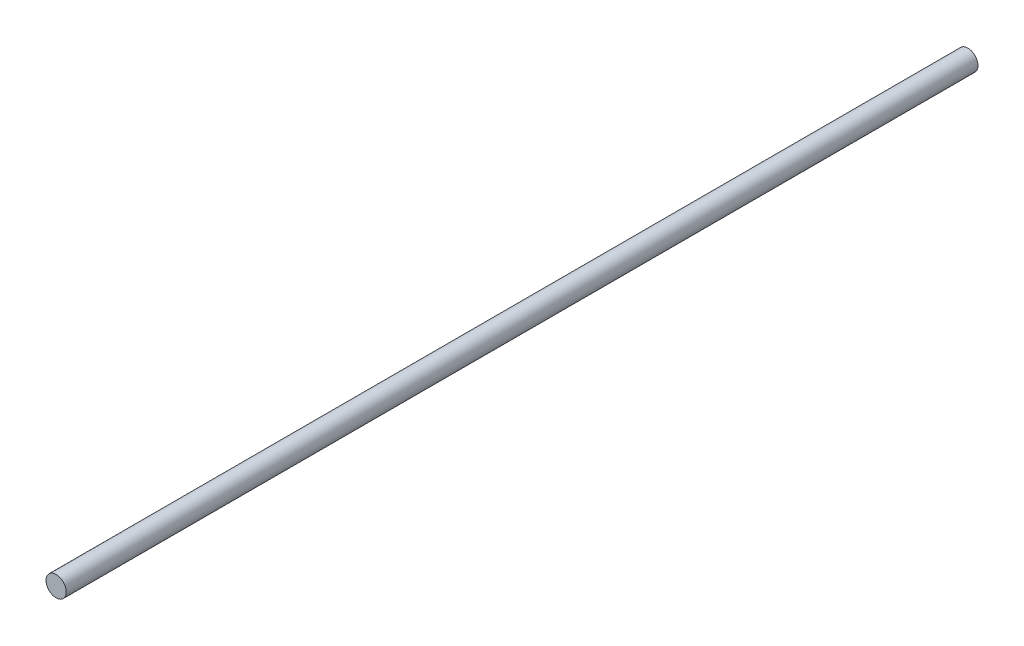
ISO-10303-21;
HEADER;
FILE_DESCRIPTION(('STEP AP214'),'2;1');
FILE_NAME('part.step','',(''),(''),'','','');
FILE_SCHEMA(('AUTOMOTIVE_DESIGN { 1 0 10303 214 1 1 1 1 }'));
ENDSEC;
DATA;
#1=APPLICATION_CONTEXT('core data for automotive mechanical design processes');
#2=APPLICATION_PROTOCOL_DEFINITION('international standard','automotive_design',2000,#1);
#3=PRODUCT_CONTEXT('',#1,'mechanical');
#4=PRODUCT('Part','Part','',(#3));
#5=PRODUCT_RELATED_PRODUCT_CATEGORY('part','',(#4));
#6=PRODUCT_DEFINITION_FORMATION('','',#4);
#7=PRODUCT_DEFINITION_CONTEXT('part definition',#1,'design');
#8=PRODUCT_DEFINITION('design','',#6,#7);
#9=PRODUCT_DEFINITION_SHAPE('','',#8);
#10=(LENGTH_UNIT() NAMED_UNIT(*) SI_UNIT(.MILLI.,.METRE.));
#11=(NAMED_UNIT(*) PLANE_ANGLE_UNIT() SI_UNIT($,.RADIAN.));
#12=(NAMED_UNIT(*) SI_UNIT($,.STERADIAN.) SOLID_ANGLE_UNIT());
#13=UNCERTAINTY_MEASURE_WITH_UNIT(LENGTH_MEASURE(1.E-05),#10,'distance_accuracy_value','');
#14=(GEOMETRIC_REPRESENTATION_CONTEXT(3) GLOBAL_UNCERTAINTY_ASSIGNED_CONTEXT((#13)) GLOBAL_UNIT_ASSIGNED_CONTEXT((#10,
#11,#12)) REPRESENTATION_CONTEXT('',''));
#15=CARTESIAN_POINT('',(0.,0.,0.));
#16=DIRECTION('',(0.,0.,1.));
#17=DIRECTION('',(1.,0.,0.));
#18=AXIS2_PLACEMENT_3D('',#15,#16,#17);
#19=CARTESIAN_POINT('',(0.,0.,360.));
#20=DIRECTION('',(0.,0.,-1.));
#21=DIRECTION('',(-1.,0.,0.));
#22=AXIS2_PLACEMENT_3D('',#19,#20,#21);
#23=CYLINDRICAL_SURFACE('',#22,4.);
#24=CARTESIAN_POINT('',(0.,0.,360.));
#25=DIRECTION('',(0.,0.,1.));
#26=DIRECTION('',(1.,0.,0.));
#27=AXIS2_PLACEMENT_3D('',#24,#25,#26);
#28=CIRCLE('',#27,4.);
#29=CARTESIAN_POINT('',(4.,0.,360.));
#30=VERTEX_POINT('',#29);
#31=EDGE_CURVE('E10',#30,#30,#28,.T.);
#32=ORIENTED_EDGE('',*,*,#31,.F.);
#33=EDGE_LOOP('',(#32));
#34=FACE_BOUND('',#33,.T.);
#35=CARTESIAN_POINT('',(0.,0.,0.));
#36=DIRECTION('',(0.,0.,1.));
#37=DIRECTION('',(1.,0.,0.));
#38=AXIS2_PLACEMENT_3D('',#35,#36,#37);
#39=CIRCLE('',#38,4.);
#40=CARTESIAN_POINT('',(4.,0.,0.));
#41=VERTEX_POINT('',#40);
#42=EDGE_CURVE('E33',#41,#41,#39,.T.);
#43=ORIENTED_EDGE('',*,*,#42,.T.);
#44=EDGE_LOOP('',(#43));
#45=FACE_BOUND('',#44,.T.);
#46=ADVANCED_FACE('F30',(#34,#45),#23,.T.);
#47=CARTESIAN_POINT('',(0.,0.,360.));
#48=DIRECTION('',(0.,0.,1.));
#49=DIRECTION('',(1.,0.,0.));
#50=AXIS2_PLACEMENT_3D('',#47,#48,#49);
#51=PLANE('',#50);
#52=ORIENTED_EDGE('',*,*,#31,.T.);
#53=EDGE_LOOP('',(#52));
#54=FACE_BOUND('',#53,.T.);
#55=ADVANCED_FACE('F45',(#54),#51,.T.);
#56=CARTESIAN_POINT('',(0.,0.,0.));
#57=DIRECTION('',(0.,0.,1.));
#58=DIRECTION('',(1.,0.,0.));
#59=AXIS2_PLACEMENT_3D('',#56,#57,#58);
#60=PLANE('',#59);
#61=ORIENTED_EDGE('',*,*,#42,.F.);
#62=EDGE_LOOP('',(#61));
#63=FACE_BOUND('',#62,.T.);
#64=ADVANCED_FACE('F43',(#63),#60,.F.);
#65=CLOSED_SHELL('',(#46,#55,#64));
#66=MANIFOLD_SOLID_BREP('B2',#65);
#67=ADVANCED_BREP_SHAPE_REPRESENTATION('',(#18,#66),#14);
#68=SHAPE_DEFINITION_REPRESENTATION(#9,#67);
ENDSEC;
END-ISO-10303-21;
